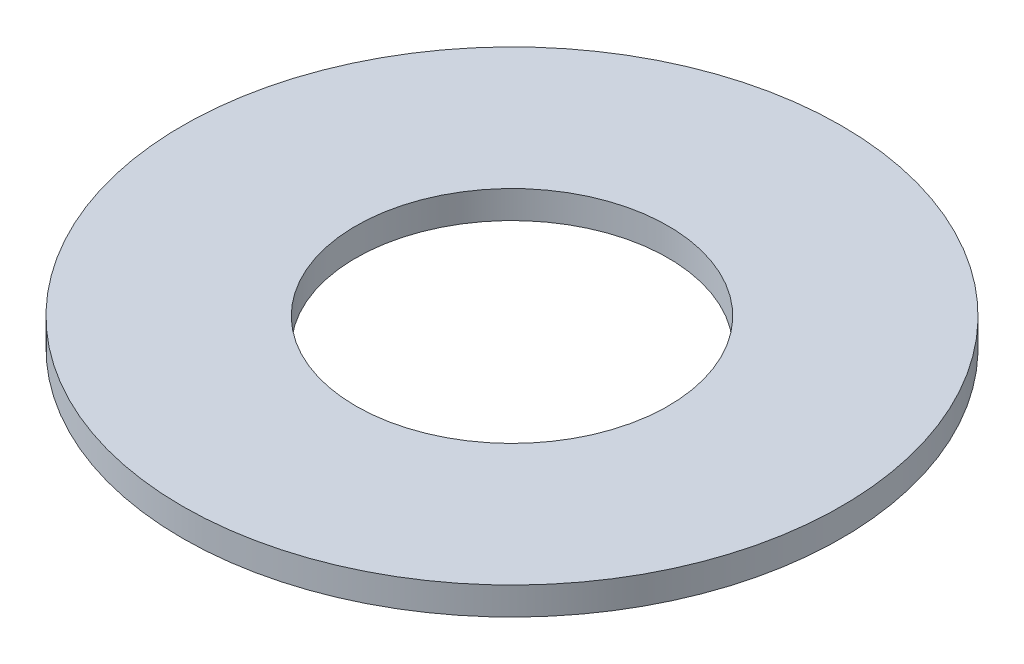
ISO-10303-21;
HEADER;
FILE_DESCRIPTION(('STEP AP214'),'2;1');
FILE_NAME('part.step','',(''),(''),'','','');
FILE_SCHEMA(('AUTOMOTIVE_DESIGN { 1 0 10303 214 1 1 1 1 }'));
ENDSEC;
DATA;
#1=APPLICATION_CONTEXT('core data for automotive mechanical design processes');
#2=APPLICATION_PROTOCOL_DEFINITION('international standard','automotive_design',2000,#1);
#3=PRODUCT_CONTEXT('',#1,'mechanical');
#4=PRODUCT('Part','Part','',(#3));
#5=PRODUCT_RELATED_PRODUCT_CATEGORY('part','',(#4));
#6=PRODUCT_DEFINITION_FORMATION('','',#4);
#7=PRODUCT_DEFINITION_CONTEXT('part definition',#1,'design');
#8=PRODUCT_DEFINITION('design','',#6,#7);
#9=PRODUCT_DEFINITION_SHAPE('','',#8);
#10=(LENGTH_UNIT() NAMED_UNIT(*) SI_UNIT(.MILLI.,.METRE.));
#11=(NAMED_UNIT(*) PLANE_ANGLE_UNIT() SI_UNIT($,.RADIAN.));
#12=(NAMED_UNIT(*) SI_UNIT($,.STERADIAN.) SOLID_ANGLE_UNIT());
#13=UNCERTAINTY_MEASURE_WITH_UNIT(LENGTH_MEASURE(1.E-05),#10,'distance_accuracy_value','');
#14=(GEOMETRIC_REPRESENTATION_CONTEXT(3) GLOBAL_UNCERTAINTY_ASSIGNED_CONTEXT((#13)) GLOBAL_UNIT_ASSIGNED_CONTEXT((#10,
#11,#12)) REPRESENTATION_CONTEXT('',''));
#15=CARTESIAN_POINT('',(0.,0.,0.));
#16=DIRECTION('',(0.,0.,1.));
#17=DIRECTION('',(1.,0.,0.));
#18=AXIS2_PLACEMENT_3D('',#15,#16,#17);
#19=CARTESIAN_POINT('',(0.,4.,0.));
#20=DIRECTION('',(0.,-1.,0.));
#21=DIRECTION('',(0.,0.,-1.));
#22=AXIS2_PLACEMENT_3D('',#19,#20,#21);
#23=CYLINDRICAL_SURFACE('',#22,47.5);
#24=CARTESIAN_POINT('',(0.,4.,0.));
#25=DIRECTION('',(0.,1.,0.));
#26=DIRECTION('',(0.,0.,1.));
#27=AXIS2_PLACEMENT_3D('',#24,#25,#26);
#28=CIRCLE('',#27,47.5);
#29=CARTESIAN_POINT('',(0.,4.,47.5));
#30=VERTEX_POINT('',#29);
#31=EDGE_CURVE('E10',#30,#30,#28,.T.);
#32=ORIENTED_EDGE('',*,*,#31,.F.);
#33=EDGE_LOOP('',(#32));
#34=FACE_BOUND('',#33,.T.);
#35=CARTESIAN_POINT('',(0.,0.,0.));
#36=DIRECTION('',(0.,1.,0.));
#37=DIRECTION('',(0.,0.,1.));
#38=AXIS2_PLACEMENT_3D('',#35,#36,#37);
#39=CIRCLE('',#38,47.5);
#40=CARTESIAN_POINT('',(0.,0.,47.5));
#41=VERTEX_POINT('',#40);
#42=EDGE_CURVE('E37',#41,#41,#39,.T.);
#43=ORIENTED_EDGE('',*,*,#42,.T.);
#44=EDGE_LOOP('',(#43));
#45=FACE_BOUND('',#44,.T.);
#46=ADVANCED_FACE('F40',(#34,#45),#23,.T.);
#47=CARTESIAN_POINT('',(0.,4.,0.));
#48=DIRECTION('',(0.,1.,0.));
#49=DIRECTION('',(0.,0.,1.));
#50=AXIS2_PLACEMENT_3D('',#47,#48,#49);
#51=PLANE('',#50);
#52=CARTESIAN_POINT('',(0.,4.,0.));
#53=DIRECTION('',(0.,1.,0.));
#54=DIRECTION('',(0.,0.,1.));
#55=AXIS2_PLACEMENT_3D('',#52,#53,#54);
#56=CIRCLE('',#55,22.5);
#57=CARTESIAN_POINT('',(0.,4.,22.5));
#58=VERTEX_POINT('',#57);
#59=EDGE_CURVE('E50',#58,#58,#56,.T.);
#60=ORIENTED_EDGE('',*,*,#59,.F.);
#61=EDGE_LOOP('',(#60));
#62=FACE_BOUND('',#61,.T.);
#63=ORIENTED_EDGE('',*,*,#31,.T.);
#64=EDGE_LOOP('',(#63));
#65=FACE_BOUND('',#64,.T.);
#66=ADVANCED_FACE('F59',(#62,#65),#51,.T.);
#67=CARTESIAN_POINT('',(0.,0.,0.));
#68=DIRECTION('',(0.,1.,0.));
#69=DIRECTION('',(0.,0.,1.));
#70=AXIS2_PLACEMENT_3D('',#67,#68,#69);
#71=PLANE('',#70);
#72=CARTESIAN_POINT('',(0.,0.,0.));
#73=DIRECTION('',(0.,1.,0.));
#74=DIRECTION('',(0.,0.,1.));
#75=AXIS2_PLACEMENT_3D('',#72,#73,#74);
#76=CIRCLE('',#75,22.5);
#77=CARTESIAN_POINT('',(0.,0.,22.5));
#78=VERTEX_POINT('',#77);
#79=EDGE_CURVE('E47',#78,#78,#76,.T.);
#80=ORIENTED_EDGE('',*,*,#79,.T.);
#81=EDGE_LOOP('',(#80));
#82=FACE_BOUND('',#81,.T.);
#83=ORIENTED_EDGE('',*,*,#42,.F.);
#84=EDGE_LOOP('',(#83));
#85=FACE_BOUND('',#84,.T.);
#86=ADVANCED_FACE('F58',(#82,#85),#71,.F.);
#87=CARTESIAN_POINT('',(0.,4.,0.));
#88=DIRECTION('',(0.,-1.,0.));
#89=DIRECTION('',(0.,0.,-1.));
#90=AXIS2_PLACEMENT_3D('',#87,#88,#89);
#91=CYLINDRICAL_SURFACE('',#90,22.5);
#92=ORIENTED_EDGE('',*,*,#59,.T.);
#93=EDGE_LOOP('',(#92));
#94=FACE_BOUND('',#93,.T.);
#95=ORIENTED_EDGE('',*,*,#79,.F.);
#96=EDGE_LOOP('',(#95));
#97=FACE_BOUND('',#96,.T.);
#98=ADVANCED_FACE('F54',(#94,#97),#91,.F.);
#99=CLOSED_SHELL('',(#46,#66,#86,#98));
#100=MANIFOLD_SOLID_BREP('B2',#99);
#101=ADVANCED_BREP_SHAPE_REPRESENTATION('',(#18,#100),#14);
#102=SHAPE_DEFINITION_REPRESENTATION(#9,#101);
ENDSEC;
END-ISO-10303-21;
